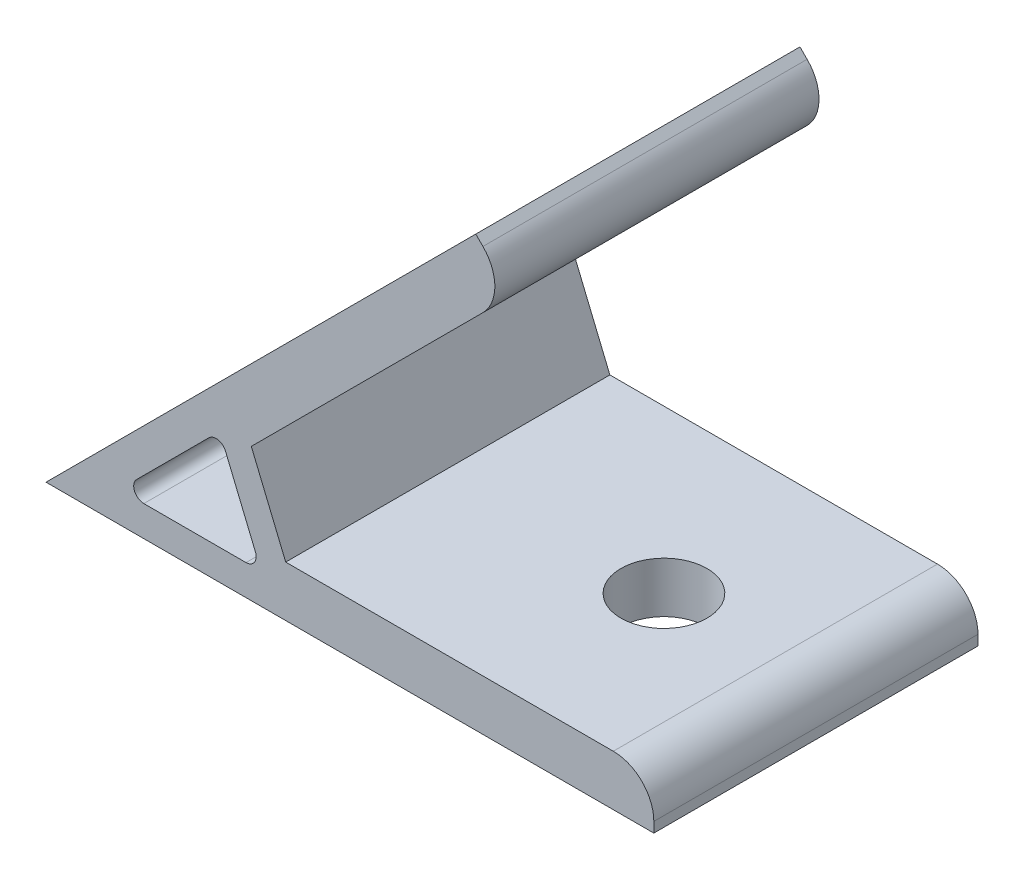
ISO-10303-21;
HEADER;
FILE_DESCRIPTION(('STEP AP214'),'2;1');
FILE_NAME('part.step','',(''),(''),'','','');
FILE_SCHEMA(('AUTOMOTIVE_DESIGN { 1 0 10303 214 1 1 1 1 }'));
ENDSEC;
DATA;
#1=APPLICATION_CONTEXT('core data for automotive mechanical design processes');
#2=APPLICATION_PROTOCOL_DEFINITION('international standard','automotive_design',2000,#1);
#3=PRODUCT_CONTEXT('',#1,'mechanical');
#4=PRODUCT('Part','Part','',(#3));
#5=PRODUCT_RELATED_PRODUCT_CATEGORY('part','',(#4));
#6=PRODUCT_DEFINITION_FORMATION('','',#4);
#7=PRODUCT_DEFINITION_CONTEXT('part definition',#1,'design');
#8=PRODUCT_DEFINITION('design','',#6,#7);
#9=PRODUCT_DEFINITION_SHAPE('','',#8);
#10=(LENGTH_UNIT() NAMED_UNIT(*) SI_UNIT(.MILLI.,.METRE.));
#11=(NAMED_UNIT(*) PLANE_ANGLE_UNIT() SI_UNIT($,.RADIAN.));
#12=(NAMED_UNIT(*) SI_UNIT($,.STERADIAN.) SOLID_ANGLE_UNIT());
#13=UNCERTAINTY_MEASURE_WITH_UNIT(LENGTH_MEASURE(1.E-05),#10,'distance_accuracy_value','');
#14=(GEOMETRIC_REPRESENTATION_CONTEXT(3) GLOBAL_UNCERTAINTY_ASSIGNED_CONTEXT((#13)) GLOBAL_UNIT_ASSIGNED_CONTEXT((#10,
#11,#12)) REPRESENTATION_CONTEXT('',''));
#15=CARTESIAN_POINT('',(0.,0.,0.));
#16=DIRECTION('',(0.,0.,1.));
#17=DIRECTION('',(1.,0.,0.));
#18=AXIS2_PLACEMENT_3D('',#15,#16,#17);
#19=CARTESIAN_POINT('',(0.,0.,16.));
#20=DIRECTION('',(0.,0.,1.));
#21=DIRECTION('',(1.,0.,0.));
#22=AXIS2_PLACEMENT_3D('',#19,#20,#21);
#23=PLANE('',#22);
#24=DIRECTION('',(0.,1.,0.));
#25=VECTOR('',#24,1.);
#26=CARTESIAN_POINT('',(60.,5.,16.));
#27=LINE('',#26,#25);
#28=CARTESIAN_POINT('',(60.,0.,16.));
#29=VERTEX_POINT('',#28);
#30=CARTESIAN_POINT('',(60.,1.,16.));
#31=VERTEX_POINT('',#30);
#32=EDGE_CURVE('E142',#29,#31,#27,.T.);
#33=ORIENTED_EDGE('',*,*,#32,.T.);
#34=CARTESIAN_POINT('',(56.,1.,16.));
#35=DIRECTION('',(0.,0.,1.));
#36=DIRECTION('',(1.,0.,0.));
#37=AXIS2_PLACEMENT_3D('',#34,#35,#36);
#38=CIRCLE('',#37,4.);
#39=CARTESIAN_POINT('',(56.,5.,16.));
#40=VERTEX_POINT('',#39);
#41=EDGE_CURVE('E184',#31,#40,#38,.T.);
#42=ORIENTED_EDGE('',*,*,#41,.T.);
#43=DIRECTION('',(-1.,0.,0.));
#44=VECTOR('',#43,1.);
#45=CARTESIAN_POINT('',(23.6613901632503,5.,16.));
#46=LINE('',#45,#44);
#47=CARTESIAN_POINT('',(23.6613901632503,5.,16.));
#48=VERTEX_POINT('',#47);
#49=EDGE_CURVE('E153',#40,#48,#46,.T.);
#50=ORIENTED_EDGE('',*,*,#49,.T.);
#51=DIRECTION('',(-0.382683432365087,0.923879532511288,0.));
#52=VECTOR('',#51,1.);
#53=CARTESIAN_POINT('',(20.2666633426678,13.1955955308021,16.));
#54=LINE('',#53,#52);
#55=CARTESIAN_POINT('',(20.2666633426678,13.1955955308021,16.));
#56=VERTEX_POINT('',#55);
#57=EDGE_CURVE('E244',#48,#56,#54,.T.);
#58=ORIENTED_EDGE('',*,*,#57,.T.);
#59=DIRECTION('',(0.707106781186551,0.707106781186544,0.));
#60=VECTOR('',#59,1.);
#61=CARTESIAN_POINT('',(45.9619407771258,38.8908729652599,16.));
#62=LINE('',#61,#60);
#63=CARTESIAN_POINT('',(43.1335136523796,36.0624458405137,16.));
#64=VERTEX_POINT('',#63);
#65=EDGE_CURVE('E246',#56,#64,#62,.T.);
#66=ORIENTED_EDGE('',*,*,#65,.T.);
#67=CARTESIAN_POINT('',(40.3050865276334,38.8908729652599,16.));
#68=DIRECTION('',(0.,0.,1.));
#69=DIRECTION('',(1.,0.,0.));
#70=AXIS2_PLACEMENT_3D('',#67,#68,#69);
#71=CIRCLE('',#70,4.);
#72=CARTESIAN_POINT('',(43.1335136523796,41.7193000900061,16.));
#73=VERTEX_POINT('',#72);
#74=EDGE_CURVE('E182',#64,#73,#71,.T.);
#75=ORIENTED_EDGE('',*,*,#74,.T.);
#76=DIRECTION('',(-0.707106781186543,0.707106781186552,0.));
#77=VECTOR('',#76,1.);
#78=CARTESIAN_POINT('',(42.4264068711931,42.4264068711926,16.));
#79=LINE('',#78,#77);
#80=CARTESIAN_POINT('',(42.4264068711931,42.4264068711926,16.));
#81=VERTEX_POINT('',#80);
#82=EDGE_CURVE('E249',#73,#81,#79,.T.);
#83=ORIENTED_EDGE('',*,*,#82,.T.);
#84=DIRECTION('',(-0.707106781186551,-0.707106781186544,0.));
#85=VECTOR('',#84,1.);
#86=CARTESIAN_POINT('',(0.,0.,16.));
#87=LINE('',#86,#85);
#88=CARTESIAN_POINT('',(0.,0.,16.));
#89=VERTEX_POINT('',#88);
#90=EDGE_CURVE('E158',#81,#89,#87,.T.);
#91=ORIENTED_EDGE('',*,*,#90,.T.);
#92=DIRECTION('',(1.,0.,0.));
#93=VECTOR('',#92,1.);
#94=CARTESIAN_POINT('',(60.,0.,16.));
#95=LINE('',#94,#93);
#96=EDGE_CURVE('E154',#89,#29,#95,.T.);
#97=ORIENTED_EDGE('',*,*,#96,.T.);
#98=EDGE_LOOP('',(#33,#42,#50,#58,#66,#75,#83,#91,#97));
#99=FACE_BOUND('',#98,.T.);
#100=DIRECTION('',(1.,0.,0.));
#101=VECTOR('',#100,1.);
#102=CARTESIAN_POINT('',(21.2426406871194,3.,16.));
#103=LINE('',#102,#101);
#104=CARTESIAN_POINT('',(9.65685424949248,3.,16.));
#105=VERTEX_POINT('',#104);
#106=CARTESIAN_POINT('',(19.7460349244539,3.,16.));
#107=VERTEX_POINT('',#106);
#108=EDGE_CURVE('E229',#105,#107,#103,.T.);
#109=ORIENTED_EDGE('',*,*,#108,.F.);
#110=CARTESIAN_POINT('',(9.65685424949247,4.,16.));
#111=DIRECTION('',(0.,0.,1.));
#112=DIRECTION('',(1.,0.,0.));
#113=AXIS2_PLACEMENT_3D('',#110,#111,#112);
#114=CIRCLE('',#113,1.);
#115=CARTESIAN_POINT('',(8.94974746830593,4.70710678118655,16.));
#116=VERTEX_POINT('',#115);
#117=EDGE_CURVE('E211',#105,#116,#114,.F.);
#118=ORIENTED_EDGE('',*,*,#117,.T.);
#119=DIRECTION('',(-0.707106781186551,-0.707106781186544,0.));
#120=VECTOR('',#119,1.);
#121=CARTESIAN_POINT('',(7.24264068711936,3.,16.));
#122=LINE('',#121,#120);
#123=CARTESIAN_POINT('',(16.0838755401874,11.841234853068,16.));
#124=VERTEX_POINT('',#123);
#125=EDGE_CURVE('E226',#124,#116,#122,.T.);
#126=ORIENTED_EDGE('',*,*,#125,.F.);
#127=CARTESIAN_POINT('',(16.790982321374,11.1341280718814,16.));
#128=DIRECTION('',(0.,0.,1.));
#129=DIRECTION('',(1.,0.,0.));
#130=AXIS2_PLACEMENT_3D('',#127,#128,#129);
#131=CIRCLE('',#130,1.);
#132=CARTESIAN_POINT('',(17.7148618538853,11.5168115042465,16.));
#133=VERTEX_POINT('',#132);
#134=EDGE_CURVE('E207',#124,#133,#131,.F.);
#135=ORIENTED_EDGE('',*,*,#134,.T.);
#136=DIRECTION('',(-0.382683432365087,0.923879532511288,0.));
#137=VECTOR('',#136,1.);
#138=CARTESIAN_POINT('',(17.1421356237311,12.8994949366116,16.));
#139=LINE('',#138,#137);
#140=CARTESIAN_POINT('',(20.6699144569652,4.38268343236509,16.));
#141=VERTEX_POINT('',#140);
#142=EDGE_CURVE('E231',#141,#133,#139,.T.);
#143=ORIENTED_EDGE('',*,*,#142,.F.);
#144=CARTESIAN_POINT('',(19.7460349244539,4.,16.));
#145=DIRECTION('',(0.,0.,1.));
#146=DIRECTION('',(1.,0.,0.));
#147=AXIS2_PLACEMENT_3D('',#144,#145,#146);
#148=CIRCLE('',#147,1.);
#149=EDGE_CURVE('E11',#141,#107,#148,.F.);
#150=ORIENTED_EDGE('',*,*,#149,.T.);
#151=EDGE_LOOP('',(#109,#118,#126,#135,#143,#150));
#152=FACE_BOUND('',#151,.T.);
#153=ADVANCED_FACE('F35',(#99,#152),#23,.T.);
#154=CARTESIAN_POINT('',(0.,0.,-16.));
#155=DIRECTION('',(0.,0.,1.));
#156=DIRECTION('',(1.,0.,0.));
#157=AXIS2_PLACEMENT_3D('',#154,#155,#156);
#158=PLANE('',#157);
#159=DIRECTION('',(-1.,0.,0.));
#160=VECTOR('',#159,1.);
#161=CARTESIAN_POINT('',(23.6613901632503,5.,-16.));
#162=LINE('',#161,#160);
#163=CARTESIAN_POINT('',(56.,5.,-16.));
#164=VERTEX_POINT('',#163);
#165=CARTESIAN_POINT('',(23.6613901632503,5.,-16.));
#166=VERTEX_POINT('',#165);
#167=EDGE_CURVE('E256',#164,#166,#162,.T.);
#168=ORIENTED_EDGE('',*,*,#167,.F.);
#169=CARTESIAN_POINT('',(56.,1.,-16.));
#170=DIRECTION('',(0.,0.,1.));
#171=DIRECTION('',(1.,0.,0.));
#172=AXIS2_PLACEMENT_3D('',#169,#170,#171);
#173=CIRCLE('',#172,4.);
#174=CARTESIAN_POINT('',(60.,1.,-16.));
#175=VERTEX_POINT('',#174);
#176=EDGE_CURVE('E179',#164,#175,#173,.F.);
#177=ORIENTED_EDGE('',*,*,#176,.T.);
#178=DIRECTION('',(0.,1.,0.));
#179=VECTOR('',#178,1.);
#180=CARTESIAN_POINT('',(60.,5.,-16.));
#181=LINE('',#180,#179);
#182=CARTESIAN_POINT('',(60.,0.,-16.));
#183=VERTEX_POINT('',#182);
#184=EDGE_CURVE('E254',#183,#175,#181,.T.);
#185=ORIENTED_EDGE('',*,*,#184,.F.);
#186=DIRECTION('',(1.,0.,0.));
#187=VECTOR('',#186,1.);
#188=CARTESIAN_POINT('',(60.,0.,-16.));
#189=LINE('',#188,#187);
#190=CARTESIAN_POINT('',(0.,0.,-16.));
#191=VERTEX_POINT('',#190);
#192=EDGE_CURVE('E166',#191,#183,#189,.T.);
#193=ORIENTED_EDGE('',*,*,#192,.F.);
#194=DIRECTION('',(-0.707106781186551,-0.707106781186544,0.));
#195=VECTOR('',#194,1.);
#196=CARTESIAN_POINT('',(0.,0.,-16.));
#197=LINE('',#196,#195);
#198=CARTESIAN_POINT('',(42.4264068711931,42.4264068711926,-16.));
#199=VERTEX_POINT('',#198);
#200=EDGE_CURVE('E162',#199,#191,#197,.T.);
#201=ORIENTED_EDGE('',*,*,#200,.F.);
#202=DIRECTION('',(-0.707106781186543,0.707106781186552,0.));
#203=VECTOR('',#202,1.);
#204=CARTESIAN_POINT('',(42.4264068711931,42.4264068711926,-16.));
#205=LINE('',#204,#203);
#206=CARTESIAN_POINT('',(43.1335136523796,41.7193000900061,-16.));
#207=VERTEX_POINT('',#206);
#208=EDGE_CURVE('E263',#207,#199,#205,.T.);
#209=ORIENTED_EDGE('',*,*,#208,.F.);
#210=CARTESIAN_POINT('',(40.3050865276334,38.8908729652599,-16.));
#211=DIRECTION('',(0.,0.,1.));
#212=DIRECTION('',(1.,0.,0.));
#213=AXIS2_PLACEMENT_3D('',#210,#211,#212);
#214=CIRCLE('',#213,4.);
#215=CARTESIAN_POINT('',(43.1335136523796,36.0624458405137,-16.));
#216=VERTEX_POINT('',#215);
#217=EDGE_CURVE('E171',#207,#216,#214,.F.);
#218=ORIENTED_EDGE('',*,*,#217,.T.);
#219=DIRECTION('',(0.707106781186551,0.707106781186544,0.));
#220=VECTOR('',#219,1.);
#221=CARTESIAN_POINT('',(45.9619407771258,38.8908729652599,-16.));
#222=LINE('',#221,#220);
#223=CARTESIAN_POINT('',(20.2666633426678,13.1955955308021,-16.));
#224=VERTEX_POINT('',#223);
#225=EDGE_CURVE('E260',#224,#216,#222,.T.);
#226=ORIENTED_EDGE('',*,*,#225,.F.);
#227=DIRECTION('',(-0.382683432365087,0.923879532511288,0.));
#228=VECTOR('',#227,1.);
#229=CARTESIAN_POINT('',(20.2666633426678,13.1955955308021,-16.));
#230=LINE('',#229,#228);
#231=EDGE_CURVE('E258',#166,#224,#230,.T.);
#232=ORIENTED_EDGE('',*,*,#231,.F.);
#233=EDGE_LOOP('',(#168,#177,#185,#193,#201,#209,#218,#226,#232));
#234=FACE_BOUND('',#233,.T.);
#235=DIRECTION('',(-0.382683432365087,0.923879532511288,0.));
#236=VECTOR('',#235,1.);
#237=CARTESIAN_POINT('',(17.1421356237311,12.8994949366116,-16.));
#238=LINE('',#237,#236);
#239=CARTESIAN_POINT('',(20.6699144569652,4.38268343236509,-16.));
#240=VERTEX_POINT('',#239);
#241=CARTESIAN_POINT('',(17.7148618538853,11.5168115042465,-16.));
#242=VERTEX_POINT('',#241);
#243=EDGE_CURVE('E217',#240,#242,#238,.T.);
#244=ORIENTED_EDGE('',*,*,#243,.T.);
#245=CARTESIAN_POINT('',(16.790982321374,11.1341280718814,-16.));
#246=DIRECTION('',(0.,0.,1.));
#247=DIRECTION('',(1.,0.,0.));
#248=AXIS2_PLACEMENT_3D('',#245,#246,#247);
#249=CIRCLE('',#248,1.);
#250=CARTESIAN_POINT('',(16.0838755401874,11.841234853068,-16.));
#251=VERTEX_POINT('',#250);
#252=EDGE_CURVE('E205',#242,#251,#249,.T.);
#253=ORIENTED_EDGE('',*,*,#252,.T.);
#254=DIRECTION('',(-0.707106781186551,-0.707106781186544,0.));
#255=VECTOR('',#254,1.);
#256=CARTESIAN_POINT('',(7.24264068711936,3.,-16.));
#257=LINE('',#256,#255);
#258=CARTESIAN_POINT('',(8.94974746830593,4.70710678118655,-16.));
#259=VERTEX_POINT('',#258);
#260=EDGE_CURVE('E238',#251,#259,#257,.T.);
#261=ORIENTED_EDGE('',*,*,#260,.T.);
#262=CARTESIAN_POINT('',(9.65685424949247,4.,-16.));
#263=DIRECTION('',(0.,0.,1.));
#264=DIRECTION('',(1.,0.,0.));
#265=AXIS2_PLACEMENT_3D('',#262,#263,#264);
#266=CIRCLE('',#265,1.);
#267=CARTESIAN_POINT('',(9.65685424949248,3.,-16.));
#268=VERTEX_POINT('',#267);
#269=EDGE_CURVE('E209',#259,#268,#266,.T.);
#270=ORIENTED_EDGE('',*,*,#269,.T.);
#271=DIRECTION('',(1.,0.,0.));
#272=VECTOR('',#271,1.);
#273=CARTESIAN_POINT('',(21.2426406871194,3.,-16.));
#274=LINE('',#273,#272);
#275=CARTESIAN_POINT('',(19.7460349244539,3.,-16.));
#276=VERTEX_POINT('',#275);
#277=EDGE_CURVE('E218',#268,#276,#274,.T.);
#278=ORIENTED_EDGE('',*,*,#277,.T.);
#279=CARTESIAN_POINT('',(19.7460349244539,4.,-16.));
#280=DIRECTION('',(0.,0.,1.));
#281=DIRECTION('',(1.,0.,0.));
#282=AXIS2_PLACEMENT_3D('',#279,#280,#281);
#283=CIRCLE('',#282,1.);
#284=EDGE_CURVE('E43',#276,#240,#283,.T.);
#285=ORIENTED_EDGE('',*,*,#284,.T.);
#286=EDGE_LOOP('',(#244,#253,#261,#270,#278,#285));
#287=FACE_BOUND('',#286,.T.);
#288=ADVANCED_FACE('F216',(#234,#287),#158,.F.);
#289=CARTESIAN_POINT('',(60.,0.,16.));
#290=DIRECTION('',(0.,1.,0.));
#291=DIRECTION('',(0.,0.,1.));
#292=AXIS2_PLACEMENT_3D('',#289,#290,#291);
#293=PLANE('',#292);
#294=CARTESIAN_POINT('',(45.,0.,0.));
#295=DIRECTION('',(0.,-1.,0.));
#296=DIRECTION('',(0.,0.,-1.));
#297=AXIS2_PLACEMENT_3D('',#294,#295,#296);
#298=CIRCLE('',#297,4.25000000000001);
#299=CARTESIAN_POINT('',(45.,0.,-4.25000000000001));
#300=VERTEX_POINT('',#299);
#301=EDGE_CURVE('E343',#300,#300,#298,.T.);
#302=ORIENTED_EDGE('',*,*,#301,.F.);
#303=EDGE_LOOP('',(#302));
#304=FACE_BOUND('',#303,.T.);
#305=ORIENTED_EDGE('',*,*,#192,.T.);
#306=DIRECTION('',(0.,0.,-1.));
#307=VECTOR('',#306,1.);
#308=CARTESIAN_POINT('',(60.,0.,16.));
#309=LINE('',#308,#307);
#310=EDGE_CURVE('E147',#29,#183,#309,.T.);
#311=ORIENTED_EDGE('',*,*,#310,.F.);
#312=ORIENTED_EDGE('',*,*,#96,.F.);
#313=DIRECTION('',(0.,0.,-1.));
#314=VECTOR('',#313,1.);
#315=CARTESIAN_POINT('',(0.,0.,16.));
#316=LINE('',#315,#314);
#317=EDGE_CURVE('E252',#89,#191,#316,.T.);
#318=ORIENTED_EDGE('',*,*,#317,.T.);
#319=EDGE_LOOP('',(#305,#311,#312,#318));
#320=FACE_BOUND('',#319,.T.);
#321=ADVANCED_FACE('F164',(#304,#320),#293,.F.);
#322=CARTESIAN_POINT('',(60.,5.,16.));
#323=DIRECTION('',(-1.,0.,0.));
#324=DIRECTION('',(0.,0.,1.));
#325=AXIS2_PLACEMENT_3D('',#322,#323,#324);
#326=PLANE('',#325);
#327=ORIENTED_EDGE('',*,*,#184,.T.);
#328=DIRECTION('',(0.,0.,-1.));
#329=VECTOR('',#328,1.);
#330=CARTESIAN_POINT('',(60.,1.,16.));
#331=LINE('',#330,#329);
#332=EDGE_CURVE('E150',#175,#31,#331,.F.);
#333=ORIENTED_EDGE('',*,*,#332,.T.);
#334=ORIENTED_EDGE('',*,*,#32,.F.);
#335=ORIENTED_EDGE('',*,*,#310,.T.);
#336=EDGE_LOOP('',(#327,#333,#334,#335));
#337=FACE_BOUND('',#336,.T.);
#338=ADVANCED_FACE('F145',(#337),#326,.F.);
#339=CARTESIAN_POINT('',(23.6613901632503,5.,16.));
#340=DIRECTION('',(0.,-1.,0.));
#341=DIRECTION('',(0.,0.,-1.));
#342=AXIS2_PLACEMENT_3D('',#339,#340,#341);
#343=PLANE('',#342);
#344=CARTESIAN_POINT('',(45.,5.,0.));
#345=DIRECTION('',(0.,-1.,0.));
#346=DIRECTION('',(0.,0.,-1.));
#347=AXIS2_PLACEMENT_3D('',#344,#345,#346);
#348=CIRCLE('',#347,4.25000000000001);
#349=CARTESIAN_POINT('',(45.,5.,-4.25000000000001));
#350=VERTEX_POINT('',#349);
#351=EDGE_CURVE('E345',#350,#350,#348,.F.);
#352=ORIENTED_EDGE('',*,*,#351,.F.);
#353=EDGE_LOOP('',(#352));
#354=FACE_BOUND('',#353,.T.);
#355=ORIENTED_EDGE('',*,*,#49,.F.);
#356=DIRECTION('',(0.,0.,-1.));
#357=VECTOR('',#356,1.);
#358=CARTESIAN_POINT('',(56.,5.,16.));
#359=LINE('',#358,#357);
#360=EDGE_CURVE('E167',#40,#164,#359,.T.);
#361=ORIENTED_EDGE('',*,*,#360,.T.);
#362=ORIENTED_EDGE('',*,*,#167,.T.);
#363=DIRECTION('',(0.,0.,-1.));
#364=VECTOR('',#363,1.);
#365=CARTESIAN_POINT('',(23.6613901632503,5.,16.));
#366=LINE('',#365,#364);
#367=EDGE_CURVE('E168',#48,#166,#366,.T.);
#368=ORIENTED_EDGE('',*,*,#367,.F.);
#369=EDGE_LOOP('',(#355,#361,#362,#368));
#370=FACE_BOUND('',#369,.T.);
#371=ADVANCED_FACE('F295',(#354,#370),#343,.F.);
#372=CARTESIAN_POINT('',(20.2666633426678,13.1955955308021,16.));
#373=DIRECTION('',(-0.923879532511288,-0.382683432365087,0.));
#374=DIRECTION('',(0.382683432365087,-0.923879532511288,0.));
#375=AXIS2_PLACEMENT_3D('',#372,#373,#374);
#376=PLANE('',#375);
#377=ORIENTED_EDGE('',*,*,#231,.T.);
#378=DIRECTION('',(0.,0.,-1.));
#379=VECTOR('',#378,1.);
#380=CARTESIAN_POINT('',(20.2666633426678,13.1955955308021,16.));
#381=LINE('',#380,#379);
#382=EDGE_CURVE('E174',#56,#224,#381,.T.);
#383=ORIENTED_EDGE('',*,*,#382,.F.);
#384=ORIENTED_EDGE('',*,*,#57,.F.);
#385=ORIENTED_EDGE('',*,*,#367,.T.);
#386=EDGE_LOOP('',(#377,#383,#384,#385));
#387=FACE_BOUND('',#386,.T.);
#388=ADVANCED_FACE('F293',(#387),#376,.F.);
#389=CARTESIAN_POINT('',(45.9619407771258,38.8908729652599,16.));
#390=DIRECTION('',(-0.707106781186544,0.707106781186551,0.));
#391=DIRECTION('',(-0.707106781186551,-0.707106781186544,0.));
#392=AXIS2_PLACEMENT_3D('',#389,#390,#391);
#393=PLANE('',#392);
#394=CARTESIAN_POINT('',(35.3553390593275,28.2842712474617,0.));
#395=DIRECTION('',(-0.707106781186544,0.707106781186551,0.));
#396=DIRECTION('',(-0.707106781186551,-0.707106781186544,0.));
#397=AXIS2_PLACEMENT_3D('',#394,#395,#396);
#398=CIRCLE('',#397,4.25);
#399=CARTESIAN_POINT('',(32.3501352392847,25.2790674274189,0.));
#400=VERTEX_POINT('',#399);
#401=EDGE_CURVE('E241',#400,#400,#398,.F.);
#402=ORIENTED_EDGE('',*,*,#401,.F.);
#403=EDGE_LOOP('',(#402));
#404=FACE_BOUND('',#403,.T.);
#405=ORIENTED_EDGE('',*,*,#225,.T.);
#406=DIRECTION('',(0.,0.,-1.));
#407=VECTOR('',#406,1.);
#408=CARTESIAN_POINT('',(43.1335136523796,36.0624458405137,16.));
#409=LINE('',#408,#407);
#410=EDGE_CURVE('E189',#216,#64,#409,.F.);
#411=ORIENTED_EDGE('',*,*,#410,.T.);
#412=ORIENTED_EDGE('',*,*,#65,.F.);
#413=ORIENTED_EDGE('',*,*,#382,.T.);
#414=EDGE_LOOP('',(#405,#411,#412,#413));
#415=FACE_BOUND('',#414,.T.);
#416=ADVANCED_FACE('F274',(#404,#415),#393,.F.);
#417=CARTESIAN_POINT('',(42.4264068711931,42.4264068711926,16.));
#418=DIRECTION('',(-0.707106781186552,-0.707106781186543,0.));
#419=DIRECTION('',(0.707106781186543,-0.707106781186552,0.));
#420=AXIS2_PLACEMENT_3D('',#417,#418,#419);
#421=PLANE('',#420);
#422=ORIENTED_EDGE('',*,*,#82,.F.);
#423=DIRECTION('',(0.,0.,-1.));
#424=VECTOR('',#423,1.);
#425=CARTESIAN_POINT('',(43.1335136523796,41.7193000900061,16.));
#426=LINE('',#425,#424);
#427=EDGE_CURVE('E186',#73,#207,#426,.T.);
#428=ORIENTED_EDGE('',*,*,#427,.T.);
#429=ORIENTED_EDGE('',*,*,#208,.T.);
#430=DIRECTION('',(0.,0.,-1.));
#431=VECTOR('',#430,1.);
#432=CARTESIAN_POINT('',(42.4264068711931,42.4264068711926,16.));
#433=LINE('',#432,#431);
#434=EDGE_CURVE('E267',#81,#199,#433,.T.);
#435=ORIENTED_EDGE('',*,*,#434,.F.);
#436=EDGE_LOOP('',(#422,#428,#429,#435));
#437=FACE_BOUND('',#436,.T.);
#438=ADVANCED_FACE('F289',(#437),#421,.F.);
#439=CARTESIAN_POINT('',(0.,0.,16.));
#440=DIRECTION('',(0.707106781186544,-0.707106781186551,0.));
#441=DIRECTION('',(0.707106781186551,0.707106781186544,0.));
#442=AXIS2_PLACEMENT_3D('',#439,#440,#441);
#443=PLANE('',#442);
#444=CARTESIAN_POINT('',(31.8198051533948,31.8198051533945,0.));
#445=DIRECTION('',(-0.707106781186544,0.707106781186551,0.));
#446=DIRECTION('',(-0.707106781186551,-0.707106781186544,0.));
#447=AXIS2_PLACEMENT_3D('',#444,#445,#446);
#448=CIRCLE('',#447,4.25);
#449=CARTESIAN_POINT('',(28.814601333352,28.8146013333516,0.));
#450=VERTEX_POINT('',#449);
#451=EDGE_CURVE('E348',#450,#450,#448,.T.);
#452=ORIENTED_EDGE('',*,*,#451,.F.);
#453=EDGE_LOOP('',(#452));
#454=FACE_BOUND('',#453,.T.);
#455=ORIENTED_EDGE('',*,*,#200,.T.);
#456=ORIENTED_EDGE('',*,*,#317,.F.);
#457=ORIENTED_EDGE('',*,*,#90,.F.);
#458=ORIENTED_EDGE('',*,*,#434,.T.);
#459=EDGE_LOOP('',(#455,#456,#457,#458));
#460=FACE_BOUND('',#459,.T.);
#461=ADVANCED_FACE('F322',(#454,#460),#443,.F.);
#462=CARTESIAN_POINT('',(7.24264068711936,3.,16.));
#463=DIRECTION('',(0.707106781186544,-0.707106781186551,0.));
#464=DIRECTION('',(0.707106781186551,0.707106781186544,0.));
#465=AXIS2_PLACEMENT_3D('',#462,#463,#464);
#466=PLANE('',#465);
#467=ORIENTED_EDGE('',*,*,#260,.F.);
#468=DIRECTION('',(0.,0.,-1.));
#469=VECTOR('',#468,1.);
#470=CARTESIAN_POINT('',(16.0838755401874,11.841234853068,16.));
#471=LINE('',#470,#469);
#472=EDGE_CURVE('E199',#251,#124,#471,.F.);
#473=ORIENTED_EDGE('',*,*,#472,.T.);
#474=ORIENTED_EDGE('',*,*,#125,.T.);
#475=DIRECTION('',(0.,0.,-1.));
#476=VECTOR('',#475,1.);
#477=CARTESIAN_POINT('',(8.94974746830593,4.70710678118655,-16.));
#478=LINE('',#477,#476);
#479=EDGE_CURVE('E196',#116,#259,#478,.T.);
#480=ORIENTED_EDGE('',*,*,#479,.T.);
#481=EDGE_LOOP('',(#467,#473,#474,#480));
#482=FACE_BOUND('',#481,.T.);
#483=ADVANCED_FACE('F319',(#482),#466,.T.);
#484=CARTESIAN_POINT('',(21.2426406871194,3.,16.));
#485=DIRECTION('',(0.,1.,0.));
#486=DIRECTION('',(0.,0.,1.));
#487=AXIS2_PLACEMENT_3D('',#484,#485,#486);
#488=PLANE('',#487);
#489=ORIENTED_EDGE('',*,*,#277,.F.);
#490=DIRECTION('',(0.,0.,-1.));
#491=VECTOR('',#490,1.);
#492=CARTESIAN_POINT('',(9.65685424949247,3.,16.));
#493=LINE('',#492,#491);
#494=EDGE_CURVE('E55',#268,#105,#493,.F.);
#495=ORIENTED_EDGE('',*,*,#494,.T.);
#496=ORIENTED_EDGE('',*,*,#108,.T.);
#497=DIRECTION('',(0.,0.,-1.));
#498=VECTOR('',#497,1.);
#499=CARTESIAN_POINT('',(19.7460349244539,3.,-16.));
#500=LINE('',#499,#498);
#501=EDGE_CURVE('E201',#107,#276,#500,.T.);
#502=ORIENTED_EDGE('',*,*,#501,.T.);
#503=EDGE_LOOP('',(#489,#495,#496,#502));
#504=FACE_BOUND('',#503,.T.);
#505=ADVANCED_FACE('F228',(#504),#488,.T.);
#506=CARTESIAN_POINT('',(17.1421356237311,12.8994949366116,16.));
#507=DIRECTION('',(-0.923879532511288,-0.382683432365087,0.));
#508=DIRECTION('',(0.382683432365087,-0.923879532511288,0.));
#509=AXIS2_PLACEMENT_3D('',#506,#507,#508);
#510=PLANE('',#509);
#511=ORIENTED_EDGE('',*,*,#142,.T.);
#512=DIRECTION('',(0.,0.,-1.));
#513=VECTOR('',#512,1.);
#514=CARTESIAN_POINT('',(17.7148618538853,11.5168115042465,-16.));
#515=LINE('',#514,#513);
#516=EDGE_CURVE('E193',#133,#242,#515,.T.);
#517=ORIENTED_EDGE('',*,*,#516,.T.);
#518=ORIENTED_EDGE('',*,*,#243,.F.);
#519=DIRECTION('',(0.,0.,-1.));
#520=VECTOR('',#519,1.);
#521=CARTESIAN_POINT('',(20.6699144569652,4.38268343236509,16.));
#522=LINE('',#521,#520);
#523=EDGE_CURVE('E191',#240,#141,#522,.F.);
#524=ORIENTED_EDGE('',*,*,#523,.T.);
#525=EDGE_LOOP('',(#511,#517,#518,#524));
#526=FACE_BOUND('',#525,.T.);
#527=ADVANCED_FACE('F224',(#526),#510,.T.);
#528=CARTESIAN_POINT('',(43.8553390593275,19.7842712474617,0.));
#529=DIRECTION('',(-0.707106781186544,0.707106781186551,0.));
#530=DIRECTION('',(-0.707106781186551,-0.707106781186544,0.));
#531=AXIS2_PLACEMENT_3D('',#528,#529,#530);
#532=CYLINDRICAL_SURFACE('',#531,4.25);
#533=ORIENTED_EDGE('',*,*,#401,.T.);
#534=EDGE_LOOP('',(#533));
#535=FACE_BOUND('',#534,.T.);
#536=ORIENTED_EDGE('',*,*,#451,.T.);
#537=EDGE_LOOP('',(#536));
#538=FACE_BOUND('',#537,.T.);
#539=ADVANCED_FACE('F308',(#535,#538),#532,.F.);
#540=CARTESIAN_POINT('',(45.,17.0208152801713,0.));
#541=DIRECTION('',(0.,-1.,0.));
#542=DIRECTION('',(0.,0.,-1.));
#543=AXIS2_PLACEMENT_3D('',#540,#541,#542);
#544=CYLINDRICAL_SURFACE('',#543,4.25000000000001);
#545=ORIENTED_EDGE('',*,*,#351,.T.);
#546=EDGE_LOOP('',(#545));
#547=FACE_BOUND('',#546,.T.);
#548=ORIENTED_EDGE('',*,*,#301,.T.);
#549=EDGE_LOOP('',(#548));
#550=FACE_BOUND('',#549,.T.);
#551=ADVANCED_FACE('F300',(#547,#550),#544,.F.);
#552=CARTESIAN_POINT('',(56.,1.,16.));
#553=DIRECTION('',(0.,0.,-1.));
#554=DIRECTION('',(-1.,0.,0.));
#555=AXIS2_PLACEMENT_3D('',#552,#553,#554);
#556=CYLINDRICAL_SURFACE('',#555,4.);
#557=ORIENTED_EDGE('',*,*,#41,.F.);
#558=ORIENTED_EDGE('',*,*,#332,.F.);
#559=ORIENTED_EDGE('',*,*,#176,.F.);
#560=ORIENTED_EDGE('',*,*,#360,.F.);
#561=EDGE_LOOP('',(#557,#558,#559,#560));
#562=FACE_BOUND('',#561,.T.);
#563=ADVANCED_FACE('F298',(#562),#556,.T.);
#564=CARTESIAN_POINT('',(40.3050865276334,38.8908729652599,16.));
#565=DIRECTION('',(0.,0.,-1.));
#566=DIRECTION('',(-1.,0.,0.));
#567=AXIS2_PLACEMENT_3D('',#564,#565,#566);
#568=CYLINDRICAL_SURFACE('',#567,4.);
#569=ORIENTED_EDGE('',*,*,#74,.F.);
#570=ORIENTED_EDGE('',*,*,#410,.F.);
#571=ORIENTED_EDGE('',*,*,#217,.F.);
#572=ORIENTED_EDGE('',*,*,#427,.F.);
#573=EDGE_LOOP('',(#569,#570,#571,#572));
#574=FACE_BOUND('',#573,.T.);
#575=ADVANCED_FACE('F286',(#574),#568,.T.);
#576=CARTESIAN_POINT('',(16.790982321374,11.1341280718814,16.));
#577=DIRECTION('',(0.,0.,1.));
#578=DIRECTION('',(1.,0.,0.));
#579=AXIS2_PLACEMENT_3D('',#576,#577,#578);
#580=CYLINDRICAL_SURFACE('',#579,1.);
#581=ORIENTED_EDGE('',*,*,#134,.F.);
#582=ORIENTED_EDGE('',*,*,#472,.F.);
#583=ORIENTED_EDGE('',*,*,#252,.F.);
#584=ORIENTED_EDGE('',*,*,#516,.F.);
#585=EDGE_LOOP('',(#581,#582,#583,#584));
#586=FACE_BOUND('',#585,.T.);
#587=ADVANCED_FACE('F306',(#586),#580,.F.);
#588=CARTESIAN_POINT('',(9.65685424949247,4.,16.));
#589=DIRECTION('',(0.,0.,1.));
#590=DIRECTION('',(1.,0.,0.));
#591=AXIS2_PLACEMENT_3D('',#588,#589,#590);
#592=CYLINDRICAL_SURFACE('',#591,1.);
#593=ORIENTED_EDGE('',*,*,#117,.F.);
#594=ORIENTED_EDGE('',*,*,#494,.F.);
#595=ORIENTED_EDGE('',*,*,#269,.F.);
#596=ORIENTED_EDGE('',*,*,#479,.F.);
#597=EDGE_LOOP('',(#593,#594,#595,#596));
#598=FACE_BOUND('',#597,.T.);
#599=ADVANCED_FACE('F378',(#598),#592,.F.);
#600=CARTESIAN_POINT('',(19.7460349244539,4.,16.));
#601=DIRECTION('',(0.,0.,1.));
#602=DIRECTION('',(1.,0.,0.));
#603=AXIS2_PLACEMENT_3D('',#600,#601,#602);
#604=CYLINDRICAL_SURFACE('',#603,1.);
#605=ORIENTED_EDGE('',*,*,#149,.F.);
#606=ORIENTED_EDGE('',*,*,#523,.F.);
#607=ORIENTED_EDGE('',*,*,#284,.F.);
#608=ORIENTED_EDGE('',*,*,#501,.F.);
#609=EDGE_LOOP('',(#605,#606,#607,#608));
#610=FACE_BOUND('',#609,.T.);
#611=ADVANCED_FACE('F37',(#610),#604,.F.);
#612=CLOSED_SHELL('',(#153,#288,#321,#338,#371,#388,#416,#438,#461,#483,#505,#527,#539,#551,
#563,#575,#587,#599,#611));
#613=MANIFOLD_SOLID_BREP('B2',#612);
#614=ADVANCED_BREP_SHAPE_REPRESENTATION('',(#18,#613),#14);
#615=SHAPE_DEFINITION_REPRESENTATION(#9,#614);
ENDSEC;
END-ISO-10303-21;
